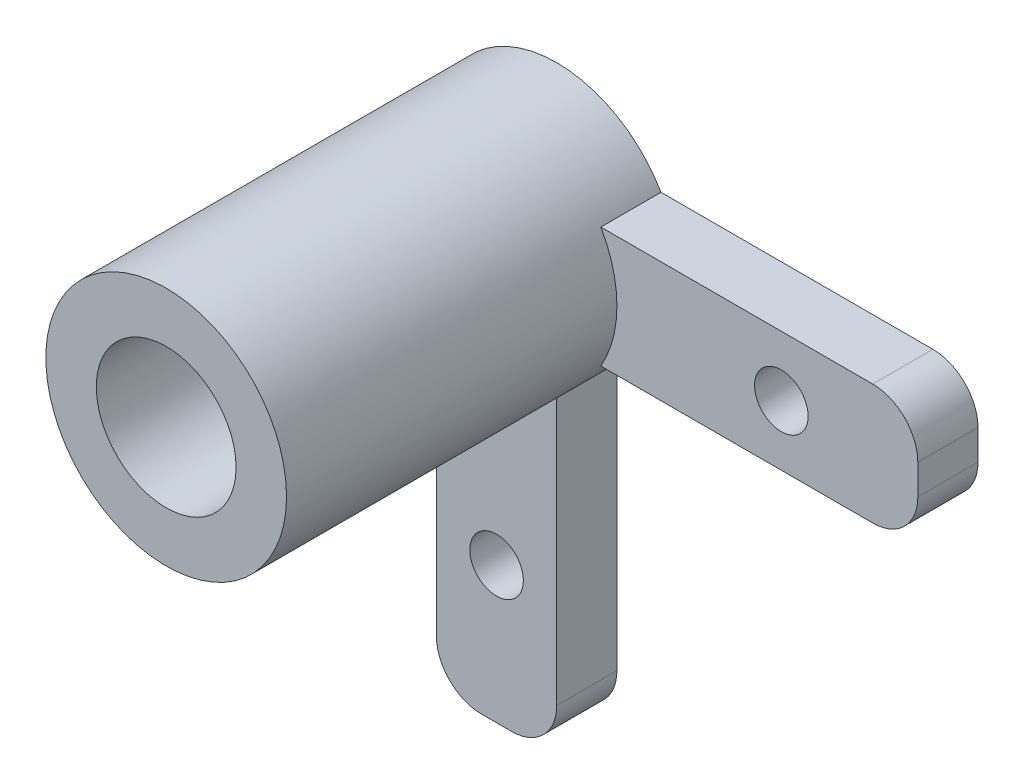
ISO-10303-21;
HEADER;
FILE_DESCRIPTION(('STEP AP214'),'2;1');
FILE_NAME('part.step','',(''),(''),'','','');
FILE_SCHEMA(('AUTOMOTIVE_DESIGN { 1 0 10303 214 1 1 1 1 }'));
ENDSEC;
DATA;
#1=APPLICATION_CONTEXT('core data for automotive mechanical design processes');
#2=APPLICATION_PROTOCOL_DEFINITION('international standard','automotive_design',2000,#1);
#3=PRODUCT_CONTEXT('',#1,'mechanical');
#4=PRODUCT('Part','Part','',(#3));
#5=PRODUCT_RELATED_PRODUCT_CATEGORY('part','',(#4));
#6=PRODUCT_DEFINITION_FORMATION('','',#4);
#7=PRODUCT_DEFINITION_CONTEXT('part definition',#1,'design');
#8=PRODUCT_DEFINITION('design','',#6,#7);
#9=PRODUCT_DEFINITION_SHAPE('','',#8);
#10=(LENGTH_UNIT() NAMED_UNIT(*) SI_UNIT(.MILLI.,.METRE.));
#11=(NAMED_UNIT(*) PLANE_ANGLE_UNIT() SI_UNIT($,.RADIAN.));
#12=(NAMED_UNIT(*) SI_UNIT($,.STERADIAN.) SOLID_ANGLE_UNIT());
#13=UNCERTAINTY_MEASURE_WITH_UNIT(LENGTH_MEASURE(1.E-05),#10,'distance_accuracy_value','');
#14=(GEOMETRIC_REPRESENTATION_CONTEXT(3) GLOBAL_UNCERTAINTY_ASSIGNED_CONTEXT((#13)) GLOBAL_UNIT_ASSIGNED_CONTEXT((#10,
#11,#12)) REPRESENTATION_CONTEXT('',''));
#15=CARTESIAN_POINT('',(0.,0.,0.));
#16=DIRECTION('',(0.,0.,1.));
#17=DIRECTION('',(1.,0.,0.));
#18=AXIS2_PLACEMENT_3D('',#15,#16,#17);
#19=CARTESIAN_POINT('',(-30.1116033533978,27.8406095566927,2.54));
#20=DIRECTION('',(0.,0.,1.));
#21=DIRECTION('',(1.,0.,0.));
#22=AXIS2_PLACEMENT_3D('',#19,#20,#21);
#23=PLANE('',#22);
#24=CARTESIAN_POINT('',(-47.8916033533979,13.2813295566927,2.54));
#25=DIRECTION('',(0.,0.,1.));
#26=DIRECTION('',(1.,0.,0.));
#27=AXIS2_PLACEMENT_3D('',#24,#25,#26);
#28=CIRCLE('',#27,1.1303);
#29=CARTESIAN_POINT('',(-46.7613033533979,13.2813295566927,2.54));
#30=VERTEX_POINT('',#29);
#31=EDGE_CURVE('E193',#30,#30,#28,.T.);
#32=ORIENTED_EDGE('',*,*,#31,.F.);
#33=EDGE_LOOP('',(#32));
#34=FACE_BOUND('',#33,.T.);
#35=DIRECTION('',(0.,-1.,0.));
#36=VECTOR('',#35,1.);
#37=CARTESIAN_POINT('',(-50.4316033533979,7.52060955669265,2.54));
#38=LINE('',#37,#36);
#39=CARTESIAN_POINT('',(-50.4316033533979,20.9012005054677,2.54));
#40=VERTEX_POINT('',#39);
#41=CARTESIAN_POINT('',(-50.4316033533979,9.42560955669265,2.54));
#42=VERTEX_POINT('',#41);
#43=EDGE_CURVE('E127',#40,#42,#38,.T.);
#44=ORIENTED_EDGE('',*,*,#43,.T.);
#45=CARTESIAN_POINT('',(-48.5266033533979,9.42560955669265,2.54));
#46=DIRECTION('',(0.,0.,1.));
#47=DIRECTION('',(1.,0.,0.));
#48=AXIS2_PLACEMENT_3D('',#45,#46,#47);
#49=CIRCLE('',#48,1.905);
#50=CARTESIAN_POINT('',(-48.5266033533979,7.52060955669265,2.54));
#51=VERTEX_POINT('',#50);
#52=EDGE_CURVE('E210',#42,#51,#49,.T.);
#53=ORIENTED_EDGE('',*,*,#52,.T.);
#54=DIRECTION('',(1.,0.,0.));
#55=VECTOR('',#54,1.);
#56=CARTESIAN_POINT('',(-45.3516033533978,7.52060955669265,2.54));
#57=LINE('',#56,#55);
#58=CARTESIAN_POINT('',(-47.2566033533978,7.52060955669265,2.54));
#59=VERTEX_POINT('',#58);
#60=EDGE_CURVE('E165',#51,#59,#57,.T.);
#61=ORIENTED_EDGE('',*,*,#60,.T.);
#62=CARTESIAN_POINT('',(-47.2566033533978,9.42560955669265,2.54));
#63=DIRECTION('',(0.,0.,1.));
#64=DIRECTION('',(1.,0.,0.));
#65=AXIS2_PLACEMENT_3D('',#62,#63,#64);
#66=CIRCLE('',#65,1.905);
#67=CARTESIAN_POINT('',(-45.3516033533978,9.42560955669265,2.54));
#68=VERTEX_POINT('',#67);
#69=EDGE_CURVE('E208',#59,#68,#66,.T.);
#70=ORIENTED_EDGE('',*,*,#69,.T.);
#71=DIRECTION('',(0.,1.,0.));
#72=VECTOR('',#71,1.);
#73=CARTESIAN_POINT('',(-45.3516033533978,22.7606095566926,2.54));
#74=LINE('',#73,#72);
#75=CARTESIAN_POINT('',(-45.3516033533978,20.9012005054677,2.54));
#76=VERTEX_POINT('',#75);
#77=EDGE_CURVE('E168',#68,#76,#74,.T.);
#78=ORIENTED_EDGE('',*,*,#77,.T.);
#79=CARTESIAN_POINT('',(-47.8916033533978,25.3006095566927,2.54));
#80=DIRECTION('',(0.,0.,1.));
#81=DIRECTION('',(1.,0.,0.));
#82=AXIS2_PLACEMENT_3D('',#79,#80,#81);
#83=CIRCLE('',#82,5.08);
#84=EDGE_CURVE('E138',#40,#76,#83,.T.);
#85=ORIENTED_EDGE('',*,*,#84,.F.);
#86=EDGE_LOOP('',(#44,#53,#61,#70,#78,#85));
#87=FACE_BOUND('',#86,.T.);
#88=ADVANCED_FACE('F31',(#34,#87),#23,.T.);
#89=CARTESIAN_POINT('',(-30.1116033533978,22.7606095566926,2.54));
#90=DIRECTION('',(-1.,0.,0.));
#91=DIRECTION('',(0.,0.,1.));
#92=AXIS2_PLACEMENT_3D('',#89,#90,#91);
#93=PLANE('',#92);
#94=DIRECTION('',(0.,1.,0.));
#95=VECTOR('',#94,1.);
#96=CARTESIAN_POINT('',(-30.1116033533978,22.7606095566926,2.54));
#97=LINE('',#96,#95);
#98=CARTESIAN_POINT('',(-30.1116033533978,24.6656095566926,2.54));
#99=VERTEX_POINT('',#98);
#100=CARTESIAN_POINT('',(-30.1116033533978,25.9356095566927,2.54));
#101=VERTEX_POINT('',#100);
#102=EDGE_CURVE('E128',#99,#101,#97,.T.);
#103=ORIENTED_EDGE('',*,*,#102,.F.);
#104=DIRECTION('',(0.,0.,-1.));
#105=VECTOR('',#104,1.);
#106=CARTESIAN_POINT('',(-30.1116033533978,24.6656095566926,2.54));
#107=LINE('',#106,#105);
#108=CARTESIAN_POINT('',(-30.1116033533978,24.6656095566926,0.));
#109=VERTEX_POINT('',#108);
#110=EDGE_CURVE('E217',#99,#109,#107,.T.);
#111=ORIENTED_EDGE('',*,*,#110,.T.);
#112=DIRECTION('',(0.,1.,0.));
#113=VECTOR('',#112,1.);
#114=CARTESIAN_POINT('',(-30.1116033533978,22.7606095566926,0.));
#115=LINE('',#114,#113);
#116=CARTESIAN_POINT('',(-30.1116033533978,25.9356095566927,0.));
#117=VERTEX_POINT('',#116);
#118=EDGE_CURVE('E158',#109,#117,#115,.T.);
#119=ORIENTED_EDGE('',*,*,#118,.T.);
#120=DIRECTION('',(0.,0.,-1.));
#121=VECTOR('',#120,1.);
#122=CARTESIAN_POINT('',(-30.1116033533978,25.9356095566927,2.54));
#123=LINE('',#122,#121);
#124=EDGE_CURVE('E215',#117,#101,#123,.F.);
#125=ORIENTED_EDGE('',*,*,#124,.T.);
#126=EDGE_LOOP('',(#103,#111,#119,#125));
#127=FACE_BOUND('',#126,.T.);
#128=ADVANCED_FACE('F226',(#127),#93,.F.);
#129=CARTESIAN_POINT('',(-30.1116033533978,27.8406095566927,2.54));
#130=DIRECTION('',(0.,-1.,0.));
#131=DIRECTION('',(1.,0.,0.));
#132=AXIS2_PLACEMENT_3D('',#129,#130,#131);
#133=PLANE('',#132);
#134=DIRECTION('',(-1.,0.,0.));
#135=VECTOR('',#134,1.);
#136=CARTESIAN_POINT('',(-30.1116033533978,27.8406095566927,2.54));
#137=LINE('',#136,#135);
#138=CARTESIAN_POINT('',(-32.0166033533978,27.8406095566927,2.54));
#139=VERTEX_POINT('',#138);
#140=CARTESIAN_POINT('',(-43.4921943021729,27.8406095566927,2.54));
#141=VERTEX_POINT('',#140);
#142=EDGE_CURVE('E120',#139,#141,#137,.T.);
#143=ORIENTED_EDGE('',*,*,#142,.F.);
#144=DIRECTION('',(0.,0.,-1.));
#145=VECTOR('',#144,1.);
#146=CARTESIAN_POINT('',(-32.0166033533978,27.8406095566927,2.54));
#147=LINE('',#146,#145);
#148=CARTESIAN_POINT('',(-32.0166033533978,27.8406095566927,0.));
#149=VERTEX_POINT('',#148);
#150=EDGE_CURVE('E11',#139,#149,#147,.T.);
#151=ORIENTED_EDGE('',*,*,#150,.T.);
#152=DIRECTION('',(-1.,0.,0.));
#153=VECTOR('',#152,1.);
#154=CARTESIAN_POINT('',(-30.1116033533978,27.8406095566927,0.));
#155=LINE('',#154,#153);
#156=CARTESIAN_POINT('',(-43.4921943021729,27.8406095566927,0.));
#157=VERTEX_POINT('',#156);
#158=EDGE_CURVE('E134',#149,#157,#155,.T.);
#159=ORIENTED_EDGE('',*,*,#158,.T.);
#160=DIRECTION('',(0.,0.,1.));
#161=VECTOR('',#160,1.);
#162=CARTESIAN_POINT('',(-43.4921943021729,27.8406095566927,0.));
#163=LINE('',#162,#161);
#164=EDGE_CURVE('E131',#157,#141,#163,.T.);
#165=ORIENTED_EDGE('',*,*,#164,.T.);
#166=EDGE_LOOP('',(#143,#151,#159,#165));
#167=FACE_BOUND('',#166,.T.);
#168=ADVANCED_FACE('F132',(#167),#133,.F.);
#169=CARTESIAN_POINT('',(-50.4316033533979,7.52060955669265,2.54));
#170=DIRECTION('',(1.,0.,0.));
#171=DIRECTION('',(0.,0.,-1.));
#172=AXIS2_PLACEMENT_3D('',#169,#170,#171);
#173=PLANE('',#172);
#174=DIRECTION('',(0.,-1.,0.));
#175=VECTOR('',#174,1.);
#176=CARTESIAN_POINT('',(-50.4316033533979,7.52060955669265,0.));
#177=LINE('',#176,#175);
#178=CARTESIAN_POINT('',(-50.4316033533979,20.9012005054677,0.));
#179=VERTEX_POINT('',#178);
#180=CARTESIAN_POINT('',(-50.4316033533979,9.42560955669265,0.));
#181=VERTEX_POINT('',#180);
#182=EDGE_CURVE('E176',#179,#181,#177,.T.);
#183=ORIENTED_EDGE('',*,*,#182,.T.);
#184=DIRECTION('',(0.,0.,-1.));
#185=VECTOR('',#184,1.);
#186=CARTESIAN_POINT('',(-50.4316033533979,9.42560955669265,2.54));
#187=LINE('',#186,#185);
#188=EDGE_CURVE('E206',#181,#42,#187,.F.);
#189=ORIENTED_EDGE('',*,*,#188,.T.);
#190=ORIENTED_EDGE('',*,*,#43,.F.);
#191=DIRECTION('',(0.,0.,1.));
#192=VECTOR('',#191,1.);
#193=CARTESIAN_POINT('',(-50.4316033533979,20.9012005054677,0.));
#194=LINE('',#193,#192);
#195=EDGE_CURVE('E154',#40,#179,#194,.F.);
#196=ORIENTED_EDGE('',*,*,#195,.T.);
#197=EDGE_LOOP('',(#183,#189,#190,#196));
#198=FACE_BOUND('',#197,.T.);
#199=ADVANCED_FACE('F323',(#198),#173,.F.);
#200=CARTESIAN_POINT('',(-45.3516033533978,7.52060955669265,2.54));
#201=DIRECTION('',(0.,1.,0.));
#202=DIRECTION('',(0.,0.,1.));
#203=AXIS2_PLACEMENT_3D('',#200,#201,#202);
#204=PLANE('',#203);
#205=ORIENTED_EDGE('',*,*,#60,.F.);
#206=DIRECTION('',(0.,0.,-1.));
#207=VECTOR('',#206,1.);
#208=CARTESIAN_POINT('',(-48.5266033533979,7.52060955669265,2.54));
#209=LINE('',#208,#207);
#210=CARTESIAN_POINT('',(-48.5266033533979,7.52060955669265,0.));
#211=VERTEX_POINT('',#210);
#212=EDGE_CURVE('E195',#51,#211,#209,.T.);
#213=ORIENTED_EDGE('',*,*,#212,.T.);
#214=DIRECTION('',(1.,0.,0.));
#215=VECTOR('',#214,1.);
#216=CARTESIAN_POINT('',(-45.3516033533978,7.52060955669265,0.));
#217=LINE('',#216,#215);
#218=CARTESIAN_POINT('',(-47.2566033533978,7.52060955669265,0.));
#219=VERTEX_POINT('',#218);
#220=EDGE_CURVE('E179',#211,#219,#217,.T.);
#221=ORIENTED_EDGE('',*,*,#220,.T.);
#222=DIRECTION('',(0.,0.,-1.));
#223=VECTOR('',#222,1.);
#224=CARTESIAN_POINT('',(-47.2566033533978,7.52060955669265,2.54));
#225=LINE('',#224,#223);
#226=EDGE_CURVE('E172',#219,#59,#225,.F.);
#227=ORIENTED_EDGE('',*,*,#226,.T.);
#228=EDGE_LOOP('',(#205,#213,#221,#227));
#229=FACE_BOUND('',#228,.T.);
#230=ADVANCED_FACE('F245',(#229),#204,.F.);
#231=CARTESIAN_POINT('',(-45.3516033533978,22.7606095566926,2.54));
#232=DIRECTION('',(-1.,0.,0.));
#233=DIRECTION('',(0.,0.,1.));
#234=AXIS2_PLACEMENT_3D('',#231,#232,#233);
#235=PLANE('',#234);
#236=ORIENTED_EDGE('',*,*,#77,.F.);
#237=DIRECTION('',(0.,0.,-1.));
#238=VECTOR('',#237,1.);
#239=CARTESIAN_POINT('',(-45.3516033533978,9.42560955669265,2.54));
#240=LINE('',#239,#238);
#241=CARTESIAN_POINT('',(-45.3516033533978,9.42560955669265,0.));
#242=VERTEX_POINT('',#241);
#243=EDGE_CURVE('E212',#68,#242,#240,.T.);
#244=ORIENTED_EDGE('',*,*,#243,.T.);
#245=DIRECTION('',(0.,1.,0.));
#246=VECTOR('',#245,1.);
#247=CARTESIAN_POINT('',(-45.3516033533978,22.7606095566926,0.));
#248=LINE('',#247,#246);
#249=CARTESIAN_POINT('',(-45.3516033533978,20.9012005054677,0.));
#250=VERTEX_POINT('',#249);
#251=EDGE_CURVE('E182',#242,#250,#248,.T.);
#252=ORIENTED_EDGE('',*,*,#251,.T.);
#253=DIRECTION('',(0.,0.,1.));
#254=VECTOR('',#253,1.);
#255=CARTESIAN_POINT('',(-45.3516033533978,20.9012005054677,0.));
#256=LINE('',#255,#254);
#257=EDGE_CURVE('E151',#250,#76,#256,.T.);
#258=ORIENTED_EDGE('',*,*,#257,.T.);
#259=EDGE_LOOP('',(#236,#244,#252,#258));
#260=FACE_BOUND('',#259,.T.);
#261=ADVANCED_FACE('F237',(#260),#235,.F.);
#262=CARTESIAN_POINT('',(-30.1116033533978,22.7606095566926,2.54));
#263=DIRECTION('',(0.,1.,0.));
#264=DIRECTION('',(0.,0.,1.));
#265=AXIS2_PLACEMENT_3D('',#262,#263,#264);
#266=PLANE('',#265);
#267=DIRECTION('',(1.,0.,0.));
#268=VECTOR('',#267,1.);
#269=CARTESIAN_POINT('',(-30.1116033533978,22.7606095566926,0.));
#270=LINE('',#269,#268);
#271=CARTESIAN_POINT('',(-43.4921943021729,22.7606095566926,0.));
#272=VERTEX_POINT('',#271);
#273=CARTESIAN_POINT('',(-32.0166033533978,22.7606095566926,0.));
#274=VERTEX_POINT('',#273);
#275=EDGE_CURVE('E161',#272,#274,#270,.T.);
#276=ORIENTED_EDGE('',*,*,#275,.T.);
#277=DIRECTION('',(0.,0.,-1.));
#278=VECTOR('',#277,1.);
#279=CARTESIAN_POINT('',(-32.0166033533978,22.7606095566926,2.54));
#280=LINE('',#279,#278);
#281=CARTESIAN_POINT('',(-32.0166033533978,22.7606095566926,2.54));
#282=VERTEX_POINT('',#281);
#283=EDGE_CURVE('E54',#274,#282,#280,.F.);
#284=ORIENTED_EDGE('',*,*,#283,.T.);
#285=DIRECTION('',(1.,0.,0.));
#286=VECTOR('',#285,1.);
#287=CARTESIAN_POINT('',(-30.1116033533978,22.7606095566926,2.54));
#288=LINE('',#287,#286);
#289=CARTESIAN_POINT('',(-43.4921943021729,22.7606095566926,2.54));
#290=VERTEX_POINT('',#289);
#291=EDGE_CURVE('E170',#290,#282,#288,.T.);
#292=ORIENTED_EDGE('',*,*,#291,.F.);
#293=DIRECTION('',(0.,0.,1.));
#294=VECTOR('',#293,1.);
#295=CARTESIAN_POINT('',(-43.4921943021729,22.7606095566926,0.));
#296=LINE('',#295,#294);
#297=EDGE_CURVE('E139',#290,#272,#296,.F.);
#298=ORIENTED_EDGE('',*,*,#297,.T.);
#299=EDGE_LOOP('',(#276,#284,#292,#298));
#300=FACE_BOUND('',#299,.T.);
#301=ADVANCED_FACE('F235',(#300),#266,.F.);
#302=CARTESIAN_POINT('',(-35.8723233533979,25.3006095566927,2.54));
#303=DIRECTION('',(0.,0.,1.));
#304=DIRECTION('',(1.,0.,0.));
#305=AXIS2_PLACEMENT_3D('',#302,#303,#304);
#306=CIRCLE('',#305,1.1303);
#307=CARTESIAN_POINT('',(-34.7420233533978,25.3006095566927,2.54));
#308=VERTEX_POINT('',#307);
#309=EDGE_CURVE('E189',#308,#308,#306,.T.);
#310=ORIENTED_EDGE('',*,*,#309,.F.);
#311=EDGE_LOOP('',(#310));
#312=FACE_BOUND('',#311,.T.);
#313=ORIENTED_EDGE('',*,*,#291,.T.);
#314=CARTESIAN_POINT('',(-32.0166033533978,24.6656095566926,2.54));
#315=DIRECTION('',(0.,0.,1.));
#316=DIRECTION('',(1.,0.,0.));
#317=AXIS2_PLACEMENT_3D('',#314,#315,#316);
#318=CIRCLE('',#317,1.905);
#319=EDGE_CURVE('E39',#282,#99,#318,.T.);
#320=ORIENTED_EDGE('',*,*,#319,.T.);
#321=ORIENTED_EDGE('',*,*,#102,.T.);
#322=CARTESIAN_POINT('',(-32.0166033533978,25.9356095566927,2.54));
#323=DIRECTION('',(0.,0.,1.));
#324=DIRECTION('',(1.,0.,0.));
#325=AXIS2_PLACEMENT_3D('',#322,#323,#324);
#326=CIRCLE('',#325,1.905);
#327=EDGE_CURVE('E46',#101,#139,#326,.T.);
#328=ORIENTED_EDGE('',*,*,#327,.T.);
#329=ORIENTED_EDGE('',*,*,#142,.T.);
#330=EDGE_CURVE('E124',#290,#141,#83,.T.);
#331=ORIENTED_EDGE('',*,*,#330,.F.);
#332=EDGE_LOOP('',(#313,#320,#321,#328,#329,#331));
#333=FACE_BOUND('',#332,.T.);
#334=ADVANCED_FACE('F122',(#312,#333),#23,.T.);
#335=CARTESIAN_POINT('',(-30.1116033533978,27.8406095566927,0.));
#336=DIRECTION('',(0.,0.,1.));
#337=DIRECTION('',(1.,0.,0.));
#338=AXIS2_PLACEMENT_3D('',#335,#336,#337);
#339=PLANE('',#338);
#340=CARTESIAN_POINT('',(-47.8916033533978,25.3006095566927,0.));
#341=DIRECTION('',(0.,0.,1.));
#342=DIRECTION('',(1.,0.,0.));
#343=AXIS2_PLACEMENT_3D('',#340,#341,#342);
#344=CIRCLE('',#343,2.95);
#345=CARTESIAN_POINT('',(-44.9416033533979,25.3006095566927,0.));
#346=VERTEX_POINT('',#345);
#347=EDGE_CURVE('E268',#346,#346,#344,.T.);
#348=ORIENTED_EDGE('',*,*,#347,.T.);
#349=EDGE_LOOP('',(#348));
#350=FACE_BOUND('',#349,.T.);
#351=CARTESIAN_POINT('',(-47.8916033533979,13.2813295566927,0.));
#352=DIRECTION('',(0.,0.,1.));
#353=DIRECTION('',(1.,0.,0.));
#354=AXIS2_PLACEMENT_3D('',#351,#352,#353);
#355=CIRCLE('',#354,1.1303);
#356=CARTESIAN_POINT('',(-46.7613033533979,13.2813295566927,0.));
#357=VERTEX_POINT('',#356);
#358=EDGE_CURVE('E190',#357,#357,#355,.T.);
#359=ORIENTED_EDGE('',*,*,#358,.T.);
#360=EDGE_LOOP('',(#359));
#361=FACE_BOUND('',#360,.T.);
#362=CARTESIAN_POINT('',(-35.8723233533979,25.3006095566927,0.));
#363=DIRECTION('',(0.,0.,1.));
#364=DIRECTION('',(1.,0.,0.));
#365=AXIS2_PLACEMENT_3D('',#362,#363,#364);
#366=CIRCLE('',#365,1.1303);
#367=CARTESIAN_POINT('',(-34.7420233533978,25.3006095566927,0.));
#368=VERTEX_POINT('',#367);
#369=EDGE_CURVE('E185',#368,#368,#366,.T.);
#370=ORIENTED_EDGE('',*,*,#369,.T.);
#371=EDGE_LOOP('',(#370));
#372=FACE_BOUND('',#371,.T.);
#373=ORIENTED_EDGE('',*,*,#220,.F.);
#374=CARTESIAN_POINT('',(-48.5266033533979,9.42560955669265,0.));
#375=DIRECTION('',(0.,0.,1.));
#376=DIRECTION('',(1.,0.,0.));
#377=AXIS2_PLACEMENT_3D('',#374,#375,#376);
#378=CIRCLE('',#377,1.905);
#379=EDGE_CURVE('E204',#211,#181,#378,.F.);
#380=ORIENTED_EDGE('',*,*,#379,.T.);
#381=ORIENTED_EDGE('',*,*,#182,.F.);
#382=CARTESIAN_POINT('',(-47.8916033533978,25.3006095566927,0.));
#383=DIRECTION('',(0.,0.,1.));
#384=DIRECTION('',(1.,0.,0.));
#385=AXIS2_PLACEMENT_3D('',#382,#383,#384);
#386=CIRCLE('',#385,5.08);
#387=EDGE_CURVE('E145',#157,#179,#386,.T.);
#388=ORIENTED_EDGE('',*,*,#387,.F.);
#389=ORIENTED_EDGE('',*,*,#158,.F.);
#390=CARTESIAN_POINT('',(-32.0166033533978,25.9356095566927,0.));
#391=DIRECTION('',(0.,0.,1.));
#392=DIRECTION('',(1.,0.,0.));
#393=AXIS2_PLACEMENT_3D('',#390,#391,#392);
#394=CIRCLE('',#393,1.905);
#395=EDGE_CURVE('E198',#149,#117,#394,.F.);
#396=ORIENTED_EDGE('',*,*,#395,.T.);
#397=ORIENTED_EDGE('',*,*,#118,.F.);
#398=CARTESIAN_POINT('',(-32.0166033533978,24.6656095566926,0.));
#399=DIRECTION('',(0.,0.,1.));
#400=DIRECTION('',(1.,0.,0.));
#401=AXIS2_PLACEMENT_3D('',#398,#399,#400);
#402=CIRCLE('',#401,1.905);
#403=EDGE_CURVE('E200',#109,#274,#402,.F.);
#404=ORIENTED_EDGE('',*,*,#403,.T.);
#405=ORIENTED_EDGE('',*,*,#275,.F.);
#406=EDGE_CURVE('E148',#250,#272,#386,.T.);
#407=ORIENTED_EDGE('',*,*,#406,.F.);
#408=ORIENTED_EDGE('',*,*,#251,.F.);
#409=CARTESIAN_POINT('',(-47.2566033533978,9.42560955669265,0.));
#410=DIRECTION('',(0.,0.,1.));
#411=DIRECTION('',(1.,0.,0.));
#412=AXIS2_PLACEMENT_3D('',#409,#410,#411);
#413=CIRCLE('',#412,1.905);
#414=EDGE_CURVE('E202',#242,#219,#413,.F.);
#415=ORIENTED_EDGE('',*,*,#414,.T.);
#416=EDGE_LOOP('',(#373,#380,#381,#388,#389,#396,#397,#404,#405,#407,#408,#415));
#417=FACE_BOUND('',#416,.T.);
#418=ADVANCED_FACE('F233',(#350,#361,#372,#417),#339,.F.);
#419=CARTESIAN_POINT('',(-47.8916033533978,25.3006095566927,0.));
#420=DIRECTION('',(0.,0.,1.));
#421=DIRECTION('',(1.,0.,0.));
#422=AXIS2_PLACEMENT_3D('',#419,#420,#421);
#423=CYLINDRICAL_SURFACE('',#422,5.08);
#424=CARTESIAN_POINT('',(-47.8916033533978,25.3006095566927,16.4846));
#425=DIRECTION('',(0.,0.,1.));
#426=DIRECTION('',(1.,0.,0.));
#427=AXIS2_PLACEMENT_3D('',#424,#425,#426);
#428=CIRCLE('',#427,5.08);
#429=CARTESIAN_POINT('',(-42.8116033533979,25.3006095566927,16.4846));
#430=VERTEX_POINT('',#429);
#431=EDGE_CURVE('E188',#430,#430,#428,.T.);
#432=ORIENTED_EDGE('',*,*,#431,.F.);
#433=EDGE_LOOP('',(#432));
#434=FACE_BOUND('',#433,.T.);
#435=ORIENTED_EDGE('',*,*,#195,.F.);
#436=ORIENTED_EDGE('',*,*,#84,.T.);
#437=ORIENTED_EDGE('',*,*,#257,.F.);
#438=ORIENTED_EDGE('',*,*,#406,.T.);
#439=ORIENTED_EDGE('',*,*,#297,.F.);
#440=ORIENTED_EDGE('',*,*,#330,.T.);
#441=ORIENTED_EDGE('',*,*,#164,.F.);
#442=ORIENTED_EDGE('',*,*,#387,.T.);
#443=EDGE_LOOP('',(#435,#436,#437,#438,#439,#440,#441,#442));
#444=FACE_BOUND('',#443,.T.);
#445=ADVANCED_FACE('F143',(#434,#444),#423,.T.);
#446=CARTESIAN_POINT('',(-47.8916033533978,25.3006095566927,16.4846));
#447=DIRECTION('',(0.,0.,1.));
#448=DIRECTION('',(1.,0.,0.));
#449=AXIS2_PLACEMENT_3D('',#446,#447,#448);
#450=PLANE('',#449);
#451=CARTESIAN_POINT('',(-47.8916033533978,25.3006095566927,16.4846));
#452=DIRECTION('',(0.,0.,1.));
#453=DIRECTION('',(1.,0.,0.));
#454=AXIS2_PLACEMENT_3D('',#451,#452,#453);
#455=CIRCLE('',#454,2.95);
#456=CARTESIAN_POINT('',(-44.9416033533979,25.3006095566927,16.4846));
#457=VERTEX_POINT('',#456);
#458=EDGE_CURVE('E300',#457,#457,#455,.T.);
#459=ORIENTED_EDGE('',*,*,#458,.F.);
#460=EDGE_LOOP('',(#459));
#461=FACE_BOUND('',#460,.T.);
#462=ORIENTED_EDGE('',*,*,#431,.T.);
#463=EDGE_LOOP('',(#462));
#464=FACE_BOUND('',#463,.T.);
#465=ADVANCED_FACE('F263',(#461,#464),#450,.T.);
#466=CARTESIAN_POINT('',(-35.8723233533979,25.3006095566927,2.54));
#467=DIRECTION('',(0.,0.,1.));
#468=DIRECTION('',(1.,0.,0.));
#469=AXIS2_PLACEMENT_3D('',#466,#467,#468);
#470=CYLINDRICAL_SURFACE('',#469,1.1303);
#471=ORIENTED_EDGE('',*,*,#309,.T.);
#472=EDGE_LOOP('',(#471));
#473=FACE_BOUND('',#472,.T.);
#474=ORIENTED_EDGE('',*,*,#369,.F.);
#475=EDGE_LOOP('',(#474));
#476=FACE_BOUND('',#475,.T.);
#477=ADVANCED_FACE('F273',(#473,#476),#470,.F.);
#478=CARTESIAN_POINT('',(-47.8916033533979,13.2813295566927,2.54));
#479=DIRECTION('',(0.,0.,1.));
#480=DIRECTION('',(1.,0.,0.));
#481=AXIS2_PLACEMENT_3D('',#478,#479,#480);
#482=CYLINDRICAL_SURFACE('',#481,1.1303);
#483=ORIENTED_EDGE('',*,*,#31,.T.);
#484=EDGE_LOOP('',(#483));
#485=FACE_BOUND('',#484,.T.);
#486=ORIENTED_EDGE('',*,*,#358,.F.);
#487=EDGE_LOOP('',(#486));
#488=FACE_BOUND('',#487,.T.);
#489=ADVANCED_FACE('F275',(#485,#488),#482,.F.);
#490=CARTESIAN_POINT('',(-47.8916033533978,25.3006095566927,0.));
#491=DIRECTION('',(0.,0.,1.));
#492=DIRECTION('',(1.,0.,0.));
#493=AXIS2_PLACEMENT_3D('',#490,#491,#492);
#494=CYLINDRICAL_SURFACE('',#493,2.95);
#495=ORIENTED_EDGE('',*,*,#347,.F.);
#496=EDGE_LOOP('',(#495));
#497=FACE_BOUND('',#496,.T.);
#498=ORIENTED_EDGE('',*,*,#458,.T.);
#499=EDGE_LOOP('',(#498));
#500=FACE_BOUND('',#499,.T.);
#501=ADVANCED_FACE('F282',(#497,#500),#494,.F.);
#502=CARTESIAN_POINT('',(-48.5266033533979,9.42560955669265,2.54));
#503=DIRECTION('',(0.,0.,-1.));
#504=DIRECTION('',(-1.,0.,0.));
#505=AXIS2_PLACEMENT_3D('',#502,#503,#504);
#506=CYLINDRICAL_SURFACE('',#505,1.905);
#507=ORIENTED_EDGE('',*,*,#52,.F.);
#508=ORIENTED_EDGE('',*,*,#188,.F.);
#509=ORIENTED_EDGE('',*,*,#379,.F.);
#510=ORIENTED_EDGE('',*,*,#212,.F.);
#511=EDGE_LOOP('',(#507,#508,#509,#510));
#512=FACE_BOUND('',#511,.T.);
#513=ADVANCED_FACE('F289',(#512),#506,.T.);
#514=CARTESIAN_POINT('',(-47.2566033533978,9.42560955669265,2.54));
#515=DIRECTION('',(0.,0.,-1.));
#516=DIRECTION('',(-1.,0.,0.));
#517=AXIS2_PLACEMENT_3D('',#514,#515,#516);
#518=CYLINDRICAL_SURFACE('',#517,1.905);
#519=ORIENTED_EDGE('',*,*,#69,.F.);
#520=ORIENTED_EDGE('',*,*,#226,.F.);
#521=ORIENTED_EDGE('',*,*,#414,.F.);
#522=ORIENTED_EDGE('',*,*,#243,.F.);
#523=EDGE_LOOP('',(#519,#520,#521,#522));
#524=FACE_BOUND('',#523,.T.);
#525=ADVANCED_FACE('F294',(#524),#518,.T.);
#526=CARTESIAN_POINT('',(-32.0166033533978,24.6656095566926,2.54));
#527=DIRECTION('',(0.,0.,-1.));
#528=DIRECTION('',(-1.,0.,0.));
#529=AXIS2_PLACEMENT_3D('',#526,#527,#528);
#530=CYLINDRICAL_SURFACE('',#529,1.905);
#531=ORIENTED_EDGE('',*,*,#319,.F.);
#532=ORIENTED_EDGE('',*,*,#283,.F.);
#533=ORIENTED_EDGE('',*,*,#403,.F.);
#534=ORIENTED_EDGE('',*,*,#110,.F.);
#535=EDGE_LOOP('',(#531,#532,#533,#534));
#536=FACE_BOUND('',#535,.T.);
#537=ADVANCED_FACE('F229',(#536),#530,.T.);
#538=CARTESIAN_POINT('',(-32.0166033533978,25.9356095566927,2.54));
#539=DIRECTION('',(0.,0.,-1.));
#540=DIRECTION('',(-1.,0.,0.));
#541=AXIS2_PLACEMENT_3D('',#538,#539,#540);
#542=CYLINDRICAL_SURFACE('',#541,1.905);
#543=ORIENTED_EDGE('',*,*,#327,.F.);
#544=ORIENTED_EDGE('',*,*,#124,.F.);
#545=ORIENTED_EDGE('',*,*,#395,.F.);
#546=ORIENTED_EDGE('',*,*,#150,.F.);
#547=EDGE_LOOP('',(#543,#544,#545,#546));
#548=FACE_BOUND('',#547,.T.);
#549=ADVANCED_FACE('F33',(#548),#542,.T.);
#550=CLOSED_SHELL('',(#88,#128,#168,#199,#230,#261,#301,#334,#418,#445,#465,#477,#489,#501,#513,
#525,#537,#549));
#551=MANIFOLD_SOLID_BREP('B2',#550);
#552=ADVANCED_BREP_SHAPE_REPRESENTATION('',(#18,#551),#14);
#553=SHAPE_DEFINITION_REPRESENTATION(#9,#552);
ENDSEC;
END-ISO-10303-21;
